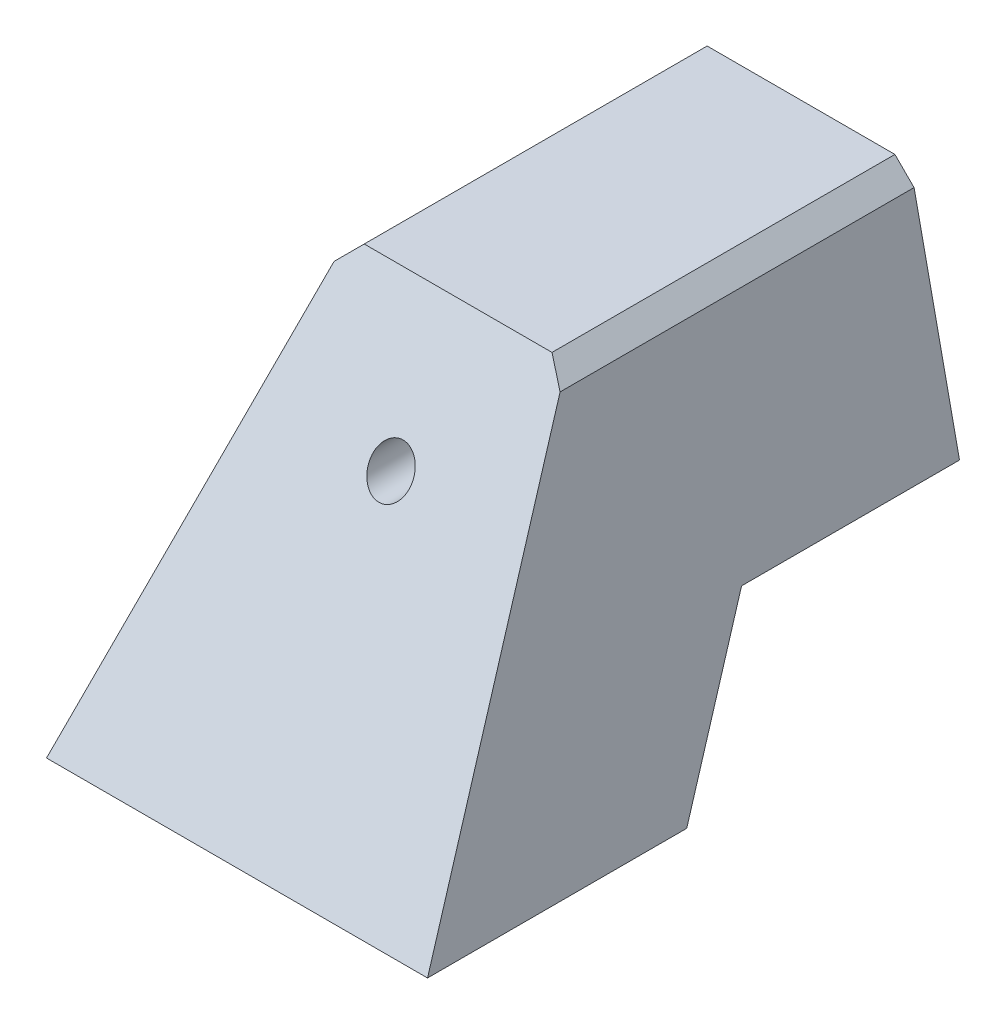
ISO-10303-21;
HEADER;
FILE_DESCRIPTION(('STEP AP214'),'2;1');
FILE_NAME('part.step','',(''),(''),'','','');
FILE_SCHEMA(('AUTOMOTIVE_DESIGN { 1 0 10303 214 1 1 1 1 }'));
ENDSEC;
DATA;
#1=APPLICATION_CONTEXT('core data for automotive mechanical design processes');
#2=APPLICATION_PROTOCOL_DEFINITION('international standard','automotive_design',2000,#1);
#3=PRODUCT_CONTEXT('',#1,'mechanical');
#4=PRODUCT('Part','Part','',(#3));
#5=PRODUCT_RELATED_PRODUCT_CATEGORY('part','',(#4));
#6=PRODUCT_DEFINITION_FORMATION('','',#4);
#7=PRODUCT_DEFINITION_CONTEXT('part definition',#1,'design');
#8=PRODUCT_DEFINITION('design','',#6,#7);
#9=PRODUCT_DEFINITION_SHAPE('','',#8);
#10=(LENGTH_UNIT() NAMED_UNIT(*) SI_UNIT(.MILLI.,.METRE.));
#11=(NAMED_UNIT(*) PLANE_ANGLE_UNIT() SI_UNIT($,.RADIAN.));
#12=(NAMED_UNIT(*) SI_UNIT($,.STERADIAN.) SOLID_ANGLE_UNIT());
#13=UNCERTAINTY_MEASURE_WITH_UNIT(LENGTH_MEASURE(1.E-05),#10,'distance_accuracy_value','');
#14=(GEOMETRIC_REPRESENTATION_CONTEXT(3) GLOBAL_UNCERTAINTY_ASSIGNED_CONTEXT((#13)) GLOBAL_UNIT_ASSIGNED_CONTEXT((#10,
#11,#12)) REPRESENTATION_CONTEXT('',''));
#15=CARTESIAN_POINT('',(0.,0.,0.));
#16=DIRECTION('',(0.,0.,1.));
#17=DIRECTION('',(1.,0.,0.));
#18=AXIS2_PLACEMENT_3D('',#15,#16,#17);
#19=CARTESIAN_POINT('',(0.,0.,0.));
#20=DIRECTION('',(0.,0.,-1.));
#21=DIRECTION('',(-1.,0.,0.));
#22=AXIS2_PLACEMENT_3D('',#19,#20,#21);
#23=PLANE('',#22);
#24=DIRECTION('',(1.,0.,0.));
#25=VECTOR('',#24,1.);
#26=CARTESIAN_POINT('',(-25.,-15.25,0.));
#27=LINE('',#26,#25);
#28=CARTESIAN_POINT('',(-20.7934268070776,-15.25,0.));
#29=VERTEX_POINT('',#28);
#30=CARTESIAN_POINT('',(20.7934268070776,-15.25,0.));
#31=VERTEX_POINT('',#30);
#32=EDGE_CURVE('E244',#29,#31,#27,.T.);
#33=ORIENTED_EDGE('',*,*,#32,.F.);
#34=DIRECTION('',(-0.208318257181608,-0.97806109406561,0.));
#35=VECTOR('',#34,1.);
#36=CARTESIAN_POINT('',(-25.,-35.,0.));
#37=LINE('',#36,#35);
#38=CARTESIAN_POINT('',(-14.8320075329272,12.7390602789383,0.));
#39=VERTEX_POINT('',#38);
#40=EDGE_CURVE('E218',#39,#29,#37,.T.);
#41=ORIENTED_EDGE('',*,*,#40,.F.);
#42=DIRECTION('',(-0.707106781186547,-0.707106781186548,0.));
#43=VECTOR('',#42,1.);
#44=CARTESIAN_POINT('',(-14.8320075329272,12.7390602789383,0.));
#45=LINE('',#44,#43);
#46=CARTESIAN_POINT('',(-12.3210678118655,15.25,0.));
#47=VERTEX_POINT('',#46);
#48=EDGE_CURVE('E215',#47,#39,#45,.T.);
#49=ORIENTED_EDGE('',*,*,#48,.F.);
#50=DIRECTION('',(-1.,0.,0.));
#51=VECTOR('',#50,1.);
#52=CARTESIAN_POINT('',(-12.3210678118655,15.25,0.));
#53=LINE('',#52,#51);
#54=CARTESIAN_POINT('',(12.3210678118655,15.25,0.));
#55=VERTEX_POINT('',#54);
#56=EDGE_CURVE('E212',#55,#47,#53,.T.);
#57=ORIENTED_EDGE('',*,*,#56,.F.);
#58=DIRECTION('',(-0.707106781186547,0.707106781186548,0.));
#59=VECTOR('',#58,1.);
#60=CARTESIAN_POINT('',(12.3210678118655,15.25,0.));
#61=LINE('',#60,#59);
#62=CARTESIAN_POINT('',(14.8320075329272,12.7390602789383,0.));
#63=VERTEX_POINT('',#62);
#64=EDGE_CURVE('E209',#63,#55,#61,.T.);
#65=ORIENTED_EDGE('',*,*,#64,.F.);
#66=DIRECTION('',(-0.208318257181608,0.97806109406561,0.));
#67=VECTOR('',#66,1.);
#68=CARTESIAN_POINT('',(14.8320075329272,12.7390602789383,0.));
#69=LINE('',#68,#67);
#70=EDGE_CURVE('E207',#31,#63,#69,.T.);
#71=ORIENTED_EDGE('',*,*,#70,.F.);
#72=EDGE_LOOP('',(#33,#41,#49,#57,#65,#71));
#73=FACE_BOUND('',#72,.T.);
#74=DIRECTION('',(1.,0.,0.));
#75=VECTOR('',#74,1.);
#76=CARTESIAN_POINT('',(-10.25,-10.25,0.));
#77=LINE('',#76,#75);
#78=CARTESIAN_POINT('',(-10.25,-10.25,0.));
#79=VERTEX_POINT('',#78);
#80=CARTESIAN_POINT('',(10.25,-10.25,0.));
#81=VERTEX_POINT('',#80);
#82=EDGE_CURVE('E196',#79,#81,#77,.T.);
#83=ORIENTED_EDGE('',*,*,#82,.T.);
#84=DIRECTION('',(0.,1.,0.));
#85=VECTOR('',#84,1.);
#86=CARTESIAN_POINT('',(10.25,-10.25,0.));
#87=LINE('',#86,#85);
#88=CARTESIAN_POINT('',(10.25,10.25,0.));
#89=VERTEX_POINT('',#88);
#90=EDGE_CURVE('E179',#81,#89,#87,.T.);
#91=ORIENTED_EDGE('',*,*,#90,.T.);
#92=DIRECTION('',(-1.,0.,0.));
#93=VECTOR('',#92,1.);
#94=CARTESIAN_POINT('',(-10.25,10.25,0.));
#95=LINE('',#94,#93);
#96=CARTESIAN_POINT('',(-10.25,10.25,0.));
#97=VERTEX_POINT('',#96);
#98=EDGE_CURVE('E190',#89,#97,#95,.T.);
#99=ORIENTED_EDGE('',*,*,#98,.T.);
#100=DIRECTION('',(0.,-1.,0.));
#101=VECTOR('',#100,1.);
#102=CARTESIAN_POINT('',(-10.25,-10.25,0.));
#103=LINE('',#102,#101);
#104=EDGE_CURVE('E193',#97,#79,#103,.T.);
#105=ORIENTED_EDGE('',*,*,#104,.T.);
#106=EDGE_LOOP('',(#83,#91,#99,#105));
#107=FACE_BOUND('',#106,.T.);
#108=ADVANCED_FACE('F38',(#73,#107),#23,.T.);
#109=CARTESIAN_POINT('',(25.,-35.,75.));
#110=DIRECTION('',(0.,1.,0.));
#111=DIRECTION('',(0.,0.,1.));
#112=AXIS2_PLACEMENT_3D('',#109,#110,#111);
#113=PLANE('',#112);
#114=DIRECTION('',(0.,0.,-1.));
#115=VECTOR('',#114,1.);
#116=CARTESIAN_POINT('',(-25.,-35.,75.));
#117=LINE('',#116,#115);
#118=CARTESIAN_POINT('',(-25.,-35.,74.011851026779));
#119=VERTEX_POINT('',#118);
#120=CARTESIAN_POINT('',(-25.,-35.,40.));
#121=VERTEX_POINT('',#120);
#122=EDGE_CURVE('E142',#119,#121,#117,.T.);
#123=ORIENTED_EDGE('',*,*,#122,.T.);
#124=DIRECTION('',(1.,0.,0.));
#125=VECTOR('',#124,1.);
#126=CARTESIAN_POINT('',(-25.,-35.,40.));
#127=LINE('',#126,#125);
#128=CARTESIAN_POINT('',(25.,-35.,40.));
#129=VERTEX_POINT('',#128);
#130=EDGE_CURVE('E129',#121,#129,#127,.T.);
#131=ORIENTED_EDGE('',*,*,#130,.T.);
#132=DIRECTION('',(0.,0.,-1.));
#133=VECTOR('',#132,1.);
#134=CARTESIAN_POINT('',(25.,-35.,75.));
#135=LINE('',#134,#133);
#136=CARTESIAN_POINT('',(25.,-35.,74.011851026779));
#137=VERTEX_POINT('',#136);
#138=EDGE_CURVE('E140',#137,#129,#135,.T.);
#139=ORIENTED_EDGE('',*,*,#138,.F.);
#140=DIRECTION('',(-1.,0.,0.));
#141=VECTOR('',#140,1.);
#142=CARTESIAN_POINT('',(25.,-35.,74.011851026779));
#143=LINE('',#142,#141);
#144=EDGE_CURVE('E164',#137,#119,#143,.T.);
#145=ORIENTED_EDGE('',*,*,#144,.T.);
#146=EDGE_LOOP('',(#123,#131,#139,#145));
#147=FACE_BOUND('',#146,.T.);
#148=ADVANCED_FACE('F40',(#147),#113,.F.);
#149=CARTESIAN_POINT('',(14.8320075329272,12.7390602789383,75.));
#150=DIRECTION('',(-0.97806109406561,-0.208318257181608,0.));
#151=DIRECTION('',(0.208318257181608,-0.97806109406561,0.));
#152=AXIS2_PLACEMENT_3D('',#149,#150,#151);
#153=PLANE('',#152);
#154=ORIENTED_EDGE('',*,*,#138,.T.);
#155=DIRECTION('',(-0.181395577793846,0.851658225620832,-0.491705105819752));
#156=VECTOR('',#155,1.);
#157=CARTESIAN_POINT('',(20.4121224517195,-13.4597634647147,27.5637386379447));
#158=LINE('',#157,#156);
#159=CARTESIAN_POINT('',(20.7934268070776,-15.25,28.5973321835048));
#160=VERTEX_POINT('',#159);
#161=EDGE_CURVE('E126',#129,#160,#158,.T.);
#162=ORIENTED_EDGE('',*,*,#161,.T.);
#163=DIRECTION('',(0.,0.,-1.));
#164=VECTOR('',#163,1.);
#165=CARTESIAN_POINT('',(20.7934268070776,-15.25,75.));
#166=LINE('',#165,#164);
#167=EDGE_CURVE('E134',#160,#31,#166,.T.);
#168=ORIENTED_EDGE('',*,*,#167,.T.);
#169=ORIENTED_EDGE('',*,*,#70,.T.);
#170=DIRECTION('',(0.,0.,-1.));
#171=VECTOR('',#170,1.);
#172=CARTESIAN_POINT('',(14.8320075329272,12.7390602789383,75.));
#173=LINE('',#172,#171);
#174=CARTESIAN_POINT('',(14.8320075329272,12.7390602789383,46.4496917238739));
#175=VERTEX_POINT('',#174);
#176=EDGE_CURVE('E149',#175,#63,#173,.T.);
#177=ORIENTED_EDGE('',*,*,#176,.F.);
#178=DIRECTION('',(0.181395577793846,-0.851658225620832,0.491705105819752));
#179=VECTOR('',#178,1.);
#180=CARTESIAN_POINT('',(17.3784989411982,0.783199057274066,53.3524114185956));
#181=LINE('',#180,#179);
#182=EDGE_CURVE('E148',#175,#137,#181,.T.);
#183=ORIENTED_EDGE('',*,*,#182,.T.);
#184=EDGE_LOOP('',(#154,#162,#168,#169,#177,#183));
#185=FACE_BOUND('',#184,.T.);
#186=ADVANCED_FACE('F146',(#185),#153,.F.);
#187=CARTESIAN_POINT('',(12.3210678118655,15.25,75.));
#188=DIRECTION('',(-0.707106781186548,-0.707106781186547,0.));
#189=DIRECTION('',(0.707106781186547,-0.707106781186548,0.));
#190=AXIS2_PLACEMENT_3D('',#187,#188,#189);
#191=PLANE('',#190);
#192=DIRECTION('',(0.,0.,-1.));
#193=VECTOR('',#192,1.);
#194=CARTESIAN_POINT('',(12.3210678118655,15.25,75.));
#195=LINE('',#194,#193);
#196=CARTESIAN_POINT('',(12.3210678118655,15.25,45.));
#197=VERTEX_POINT('',#196);
#198=EDGE_CURVE('E153',#197,#55,#195,.T.);
#199=ORIENTED_EDGE('',*,*,#198,.F.);
#200=DIRECTION('',(0.654653670707976,-0.654653670707976,0.377964473009231));
#201=VECTOR('',#200,1.);
#202=CARTESIAN_POINT('',(19.7441427014464,7.82692511041903,49.2857142857144));
#203=LINE('',#202,#201);
#204=EDGE_CURVE('E172',#197,#175,#203,.T.);
#205=ORIENTED_EDGE('',*,*,#204,.T.);
#206=ORIENTED_EDGE('',*,*,#176,.T.);
#207=ORIENTED_EDGE('',*,*,#64,.T.);
#208=EDGE_LOOP('',(#199,#205,#206,#207));
#209=FACE_BOUND('',#208,.T.);
#210=ADVANCED_FACE('F234',(#209),#191,.F.);
#211=CARTESIAN_POINT('',(-12.3210678118655,15.25,75.));
#212=DIRECTION('',(0.,-1.,0.));
#213=DIRECTION('',(0.,0.,-1.));
#214=AXIS2_PLACEMENT_3D('',#211,#212,#213);
#215=PLANE('',#214);
#216=DIRECTION('',(0.,0.,-1.));
#217=VECTOR('',#216,1.);
#218=CARTESIAN_POINT('',(-12.3210678118655,15.25,75.));
#219=LINE('',#218,#217);
#220=CARTESIAN_POINT('',(-12.3210678118655,15.25,45.));
#221=VERTEX_POINT('',#220);
#222=EDGE_CURVE('E224',#221,#47,#219,.T.);
#223=ORIENTED_EDGE('',*,*,#222,.F.);
#224=DIRECTION('',(1.,0.,0.));
#225=VECTOR('',#224,1.);
#226=CARTESIAN_POINT('',(-25.,15.25,45.));
#227=LINE('',#226,#225);
#228=EDGE_CURVE('E167',#221,#197,#227,.T.);
#229=ORIENTED_EDGE('',*,*,#228,.T.);
#230=ORIENTED_EDGE('',*,*,#198,.T.);
#231=ORIENTED_EDGE('',*,*,#56,.T.);
#232=EDGE_LOOP('',(#223,#229,#230,#231));
#233=FACE_BOUND('',#232,.T.);
#234=ADVANCED_FACE('F229',(#233),#215,.F.);
#235=CARTESIAN_POINT('',(-14.8320075329272,12.7390602789383,75.));
#236=DIRECTION('',(0.707106781186548,-0.707106781186547,0.));
#237=DIRECTION('',(0.707106781186547,0.707106781186548,0.));
#238=AXIS2_PLACEMENT_3D('',#235,#236,#237);
#239=PLANE('',#238);
#240=DIRECTION('',(0.,0.,-1.));
#241=VECTOR('',#240,1.);
#242=CARTESIAN_POINT('',(-14.8320075329272,12.7390602789383,75.));
#243=LINE('',#242,#241);
#244=CARTESIAN_POINT('',(-14.8320075329272,12.7390602789383,46.4496917238739));
#245=VERTEX_POINT('',#244);
#246=EDGE_CURVE('E222',#245,#39,#243,.T.);
#247=ORIENTED_EDGE('',*,*,#246,.F.);
#248=DIRECTION('',(0.654653670707976,0.654653670707976,-0.377964473009231));
#249=VECTOR('',#248,1.);
#250=CARTESIAN_POINT('',(-21.8963767480707,5.67469106379474,50.528307191892));
#251=LINE('',#250,#249);
#252=EDGE_CURVE('E61',#245,#221,#251,.T.);
#253=ORIENTED_EDGE('',*,*,#252,.T.);
#254=ORIENTED_EDGE('',*,*,#222,.T.);
#255=ORIENTED_EDGE('',*,*,#48,.T.);
#256=EDGE_LOOP('',(#247,#253,#254,#255));
#257=FACE_BOUND('',#256,.T.);
#258=ADVANCED_FACE('F241',(#257),#239,.F.);
#259=CARTESIAN_POINT('',(-25.,-35.,75.));
#260=DIRECTION('',(0.97806109406561,-0.208318257181608,0.));
#261=DIRECTION('',(0.208318257181608,0.97806109406561,0.));
#262=AXIS2_PLACEMENT_3D('',#259,#260,#261);
#263=PLANE('',#262);
#264=DIRECTION('',(0.,0.,1.));
#265=VECTOR('',#264,1.);
#266=CARTESIAN_POINT('',(-20.7934268070776,-15.25,75.));
#267=LINE('',#266,#265);
#268=CARTESIAN_POINT('',(-20.7934268070776,-15.25,28.5973321835048));
#269=VERTEX_POINT('',#268);
#270=EDGE_CURVE('E46',#29,#269,#267,.T.);
#271=ORIENTED_EDGE('',*,*,#270,.T.);
#272=DIRECTION('',(-0.181395577793846,-0.851658225620832,0.491705105819752));
#273=VECTOR('',#272,1.);
#274=CARTESIAN_POINT('',(-28.1217596121025,-49.6567644282904,48.4620868881225));
#275=LINE('',#274,#273);
#276=EDGE_CURVE('E12',#269,#121,#275,.T.);
#277=ORIENTED_EDGE('',*,*,#276,.T.);
#278=ORIENTED_EDGE('',*,*,#122,.F.);
#279=DIRECTION('',(0.181395577793846,0.851658225620832,-0.491705105819752));
#280=VECTOR('',#279,1.);
#281=CARTESIAN_POINT('',(-25.0881361015812,-35.4138019063016,74.2507596687734));
#282=LINE('',#281,#280);
#283=EDGE_CURVE('E158',#119,#245,#282,.T.);
#284=ORIENTED_EDGE('',*,*,#283,.T.);
#285=ORIENTED_EDGE('',*,*,#246,.T.);
#286=ORIENTED_EDGE('',*,*,#40,.T.);
#287=EDGE_LOOP('',(#271,#277,#278,#284,#285,#286));
#288=FACE_BOUND('',#287,.T.);
#289=ADVANCED_FACE('F242',(#288),#263,.F.);
#290=CARTESIAN_POINT('',(10.25,-10.25,75.));
#291=DIRECTION('',(-1.,0.,0.));
#292=DIRECTION('',(0.,0.,1.));
#293=AXIS2_PLACEMENT_3D('',#290,#291,#292);
#294=PLANE('',#293);
#295=DIRECTION('',(0.,1.,0.));
#296=VECTOR('',#295,1.);
#297=CARTESIAN_POINT('',(10.25,10.25,40.));
#298=LINE('',#297,#296);
#299=CARTESIAN_POINT('',(10.25,-10.25,40.));
#300=VERTEX_POINT('',#299);
#301=CARTESIAN_POINT('',(10.25,10.25,40.));
#302=VERTEX_POINT('',#301);
#303=EDGE_CURVE('E182',#300,#302,#298,.T.);
#304=ORIENTED_EDGE('',*,*,#303,.T.);
#305=DIRECTION('',(0.,0.,-1.));
#306=VECTOR('',#305,1.);
#307=CARTESIAN_POINT('',(10.25,10.25,75.));
#308=LINE('',#307,#306);
#309=EDGE_CURVE('E205',#302,#89,#308,.T.);
#310=ORIENTED_EDGE('',*,*,#309,.T.);
#311=ORIENTED_EDGE('',*,*,#90,.F.);
#312=DIRECTION('',(0.,0.,-1.));
#313=VECTOR('',#312,1.);
#314=CARTESIAN_POINT('',(10.25,-10.25,75.));
#315=LINE('',#314,#313);
#316=EDGE_CURVE('E199',#300,#81,#315,.T.);
#317=ORIENTED_EDGE('',*,*,#316,.F.);
#318=EDGE_LOOP('',(#304,#310,#311,#317));
#319=FACE_BOUND('',#318,.T.);
#320=ADVANCED_FACE('F261',(#319),#294,.T.);
#321=CARTESIAN_POINT('',(-10.25,10.25,75.));
#322=DIRECTION('',(0.,-1.,0.));
#323=DIRECTION('',(0.,0.,-1.));
#324=AXIS2_PLACEMENT_3D('',#321,#322,#323);
#325=PLANE('',#324);
#326=DIRECTION('',(-1.,0.,0.));
#327=VECTOR('',#326,1.);
#328=CARTESIAN_POINT('',(-10.25,10.25,40.));
#329=LINE('',#328,#327);
#330=CARTESIAN_POINT('',(-10.25,10.25,40.));
#331=VERTEX_POINT('',#330);
#332=EDGE_CURVE('E185',#302,#331,#329,.T.);
#333=ORIENTED_EDGE('',*,*,#332,.T.);
#334=DIRECTION('',(0.,0.,-1.));
#335=VECTOR('',#334,1.);
#336=CARTESIAN_POINT('',(-10.25,10.25,75.));
#337=LINE('',#336,#335);
#338=EDGE_CURVE('E203',#331,#97,#337,.T.);
#339=ORIENTED_EDGE('',*,*,#338,.T.);
#340=ORIENTED_EDGE('',*,*,#98,.F.);
#341=ORIENTED_EDGE('',*,*,#309,.F.);
#342=EDGE_LOOP('',(#333,#339,#340,#341));
#343=FACE_BOUND('',#342,.T.);
#344=ADVANCED_FACE('F298',(#343),#325,.T.);
#345=CARTESIAN_POINT('',(-10.25,-10.25,75.));
#346=DIRECTION('',(1.,0.,0.));
#347=DIRECTION('',(0.,0.,-1.));
#348=AXIS2_PLACEMENT_3D('',#345,#346,#347);
#349=PLANE('',#348);
#350=DIRECTION('',(0.,-1.,0.));
#351=VECTOR('',#350,1.);
#352=CARTESIAN_POINT('',(-10.25,10.25,40.));
#353=LINE('',#352,#351);
#354=CARTESIAN_POINT('',(-10.25,-10.25,40.));
#355=VERTEX_POINT('',#354);
#356=EDGE_CURVE('E133',#331,#355,#353,.T.);
#357=ORIENTED_EDGE('',*,*,#356,.T.);
#358=DIRECTION('',(0.,0.,-1.));
#359=VECTOR('',#358,1.);
#360=CARTESIAN_POINT('',(-10.25,-10.25,75.));
#361=LINE('',#360,#359);
#362=EDGE_CURVE('E201',#355,#79,#361,.T.);
#363=ORIENTED_EDGE('',*,*,#362,.T.);
#364=ORIENTED_EDGE('',*,*,#104,.F.);
#365=ORIENTED_EDGE('',*,*,#338,.F.);
#366=EDGE_LOOP('',(#357,#363,#364,#365));
#367=FACE_BOUND('',#366,.T.);
#368=ADVANCED_FACE('F305',(#367),#349,.T.);
#369=CARTESIAN_POINT('',(-10.25,-10.25,75.));
#370=DIRECTION('',(0.,1.,0.));
#371=DIRECTION('',(0.,0.,1.));
#372=AXIS2_PLACEMENT_3D('',#369,#370,#371);
#373=PLANE('',#372);
#374=DIRECTION('',(1.,0.,0.));
#375=VECTOR('',#374,1.);
#376=CARTESIAN_POINT('',(-10.25,-10.25,40.));
#377=LINE('',#376,#375);
#378=EDGE_CURVE('E180',#355,#300,#377,.T.);
#379=ORIENTED_EDGE('',*,*,#378,.T.);
#380=ORIENTED_EDGE('',*,*,#316,.T.);
#381=ORIENTED_EDGE('',*,*,#82,.F.);
#382=ORIENTED_EDGE('',*,*,#362,.F.);
#383=EDGE_LOOP('',(#379,#380,#381,#382));
#384=FACE_BOUND('',#383,.T.);
#385=ADVANCED_FACE('F312',(#384),#373,.T.);
#386=CARTESIAN_POINT('',(0.,0.,-28.9913780286484));
#387=DIRECTION('',(0.,0.,1.));
#388=DIRECTION('',(1.,0.,0.));
#389=AXIS2_PLACEMENT_3D('',#386,#387,#388);
#390=CYLINDRICAL_SURFACE('',#389,2.75);
#391=CARTESIAN_POINT('',(0.,0.,53.8045916051419));
#392=DIRECTION('',(0.,-0.500000000000004,-0.866025403784436));
#393=DIRECTION('',(0.,-0.866025403784436,0.500000000000004));
#394=AXIS2_PLACEMENT_3D('',#391,#392,#393);
#395=ELLIPSE('',#394,3.17542648054295,2.75);
#396=CARTESIAN_POINT('',(0.,-2.75,55.3923048454134));
#397=VERTEX_POINT('',#396);
#398=EDGE_CURVE('E143',#397,#397,#395,.F.);
#399=ORIENTED_EDGE('',*,*,#398,.T.);
#400=EDGE_LOOP('',(#399));
#401=FACE_BOUND('',#400,.T.);
#402=CARTESIAN_POINT('',(0.,0.,40.));
#403=DIRECTION('',(0.,0.,-1.));
#404=DIRECTION('',(-1.,0.,0.));
#405=AXIS2_PLACEMENT_3D('',#402,#403,#404);
#406=CIRCLE('',#405,2.75);
#407=CARTESIAN_POINT('',(-2.75,0.,40.));
#408=VERTEX_POINT('',#407);
#409=EDGE_CURVE('E176',#408,#408,#406,.F.);
#410=ORIENTED_EDGE('',*,*,#409,.F.);
#411=EDGE_LOOP('',(#410));
#412=FACE_BOUND('',#411,.T.);
#413=ADVANCED_FACE('F320',(#401,#412),#390,.F.);
#414=CARTESIAN_POINT('',(0.,0.,40.));
#415=DIRECTION('',(0.,0.,-1.));
#416=DIRECTION('',(-1.,0.,0.));
#417=AXIS2_PLACEMENT_3D('',#414,#415,#416);
#418=PLANE('',#417);
#419=ORIENTED_EDGE('',*,*,#356,.F.);
#420=ORIENTED_EDGE('',*,*,#332,.F.);
#421=ORIENTED_EDGE('',*,*,#303,.F.);
#422=ORIENTED_EDGE('',*,*,#378,.F.);
#423=EDGE_LOOP('',(#419,#420,#421,#422));
#424=FACE_BOUND('',#423,.T.);
#425=ORIENTED_EDGE('',*,*,#409,.T.);
#426=EDGE_LOOP('',(#425));
#427=FACE_BOUND('',#426,.T.);
#428=ADVANCED_FACE('F328',(#424,#427),#418,.T.);
#429=CARTESIAN_POINT('',(-25.,15.25,45.));
#430=DIRECTION('',(0.,-0.500000000000004,-0.866025403784436));
#431=DIRECTION('',(0.,0.866025403784436,-0.500000000000004));
#432=AXIS2_PLACEMENT_3D('',#429,#430,#431);
#433=PLANE('',#432);
#434=ORIENTED_EDGE('',*,*,#398,.F.);
#435=EDGE_LOOP('',(#434));
#436=FACE_BOUND('',#435,.T.);
#437=ORIENTED_EDGE('',*,*,#228,.F.);
#438=ORIENTED_EDGE('',*,*,#252,.F.);
#439=ORIENTED_EDGE('',*,*,#283,.F.);
#440=ORIENTED_EDGE('',*,*,#144,.F.);
#441=ORIENTED_EDGE('',*,*,#182,.F.);
#442=ORIENTED_EDGE('',*,*,#204,.F.);
#443=EDGE_LOOP('',(#437,#438,#439,#440,#441,#442));
#444=FACE_BOUND('',#443,.T.);
#445=ADVANCED_FACE('F251',(#436,#444),#433,.F.);
#446=CARTESIAN_POINT('',(-25.,-15.25,28.5973321835048));
#447=DIRECTION('',(0.,0.500000000000004,0.866025403784436));
#448=DIRECTION('',(0.,-0.866025403784436,0.500000000000004));
#449=AXIS2_PLACEMENT_3D('',#446,#447,#448);
#450=PLANE('',#449);
#451=ORIENTED_EDGE('',*,*,#130,.F.);
#452=ORIENTED_EDGE('',*,*,#276,.F.);
#453=DIRECTION('',(1.,0.,0.));
#454=VECTOR('',#453,1.);
#455=CARTESIAN_POINT('',(-25.,-15.25,28.5973321835048));
#456=LINE('',#455,#454);
#457=EDGE_CURVE('E53',#269,#160,#456,.T.);
#458=ORIENTED_EDGE('',*,*,#457,.T.);
#459=ORIENTED_EDGE('',*,*,#161,.F.);
#460=EDGE_LOOP('',(#451,#452,#458,#459));
#461=FACE_BOUND('',#460,.T.);
#462=ADVANCED_FACE('F128',(#461),#450,.F.);
#463=CARTESIAN_POINT('',(-25.,-15.25,0.));
#464=DIRECTION('',(0.,1.,0.));
#465=DIRECTION('',(0.,0.,1.));
#466=AXIS2_PLACEMENT_3D('',#463,#464,#465);
#467=PLANE('',#466);
#468=ORIENTED_EDGE('',*,*,#457,.F.);
#469=ORIENTED_EDGE('',*,*,#270,.F.);
#470=ORIENTED_EDGE('',*,*,#32,.T.);
#471=ORIENTED_EDGE('',*,*,#167,.F.);
#472=EDGE_LOOP('',(#468,#469,#470,#471));
#473=FACE_BOUND('',#472,.T.);
#474=ADVANCED_FACE('F243',(#473),#467,.F.);
#475=CLOSED_SHELL('',(#108,#148,#186,#210,#234,#258,#289,#320,#344,#368,#385,#413,#428,#445,
#462,#474));
#476=MANIFOLD_SOLID_BREP('B2',#475);
#477=ADVANCED_BREP_SHAPE_REPRESENTATION('',(#18,#476),#14);
#478=SHAPE_DEFINITION_REPRESENTATION(#9,#477);
ENDSEC;
END-ISO-10303-21;
